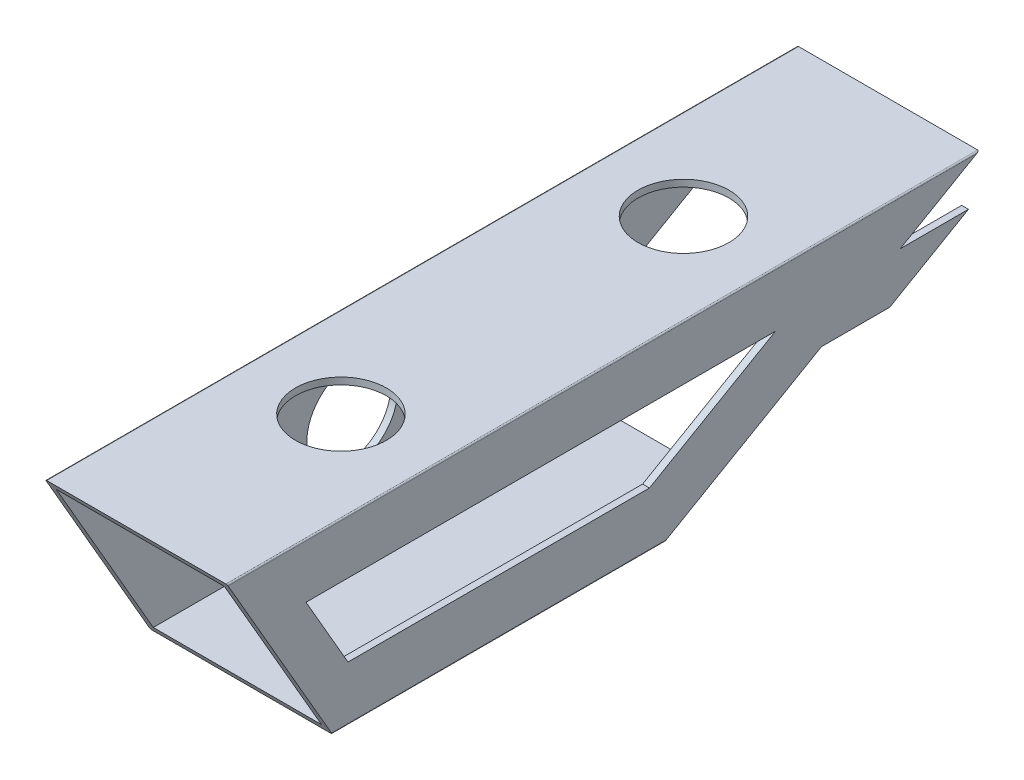
ISO-10303-21;
HEADER;
FILE_DESCRIPTION(('STEP AP214'),'2;1');
FILE_NAME('part.step','',(''),(''),'','','');
FILE_SCHEMA(('AUTOMOTIVE_DESIGN { 1 0 10303 214 1 1 1 1 }'));
ENDSEC;
DATA;
#1=APPLICATION_CONTEXT('core data for automotive mechanical design processes');
#2=APPLICATION_PROTOCOL_DEFINITION('international standard','automotive_design',2000,#1);
#3=PRODUCT_CONTEXT('',#1,'mechanical');
#4=PRODUCT('Part','Part','',(#3));
#5=PRODUCT_RELATED_PRODUCT_CATEGORY('part','',(#4));
#6=PRODUCT_DEFINITION_FORMATION('','',#4);
#7=PRODUCT_DEFINITION_CONTEXT('part definition',#1,'design');
#8=PRODUCT_DEFINITION('design','',#6,#7);
#9=PRODUCT_DEFINITION_SHAPE('','',#8);
#10=(LENGTH_UNIT() NAMED_UNIT(*) SI_UNIT(.MILLI.,.METRE.));
#11=(NAMED_UNIT(*) PLANE_ANGLE_UNIT() SI_UNIT($,.RADIAN.));
#12=(NAMED_UNIT(*) SI_UNIT($,.STERADIAN.) SOLID_ANGLE_UNIT());
#13=UNCERTAINTY_MEASURE_WITH_UNIT(LENGTH_MEASURE(1.E-05),#10,'distance_accuracy_value','');
#14=(GEOMETRIC_REPRESENTATION_CONTEXT(3) GLOBAL_UNCERTAINTY_ASSIGNED_CONTEXT((#13)) GLOBAL_UNIT_ASSIGNED_CONTEXT((#10,
#11,#12)) REPRESENTATION_CONTEXT('',''));
#15=CARTESIAN_POINT('',(0.,0.,0.));
#16=DIRECTION('',(0.,0.,1.));
#17=DIRECTION('',(1.,0.,0.));
#18=AXIS2_PLACEMENT_3D('',#15,#16,#17);
#19=CARTESIAN_POINT('',(-9.99999999999999,40.,0.));
#20=DIRECTION('',(0.,0.866025403784436,0.500000000000004));
#21=DIRECTION('',(0.,-0.500000000000004,0.866025403784436));
#22=AXIS2_PLACEMENT_3D('',#19,#20,#21);
#23=PLANE('',#22);
#24=DIRECTION('',(1.,0.,0.));
#25=VECTOR('',#24,1.);
#26=CARTESIAN_POINT('',(38.5,30.0000000000004,17.3205080756879));
#27=LINE('',#26,#25);
#28=CARTESIAN_POINT('',(38.5,30.0000000000004,17.3205080756879));
#29=VERTEX_POINT('',#28);
#30=CARTESIAN_POINT('',(40.,30.0000000000004,17.3205080756879));
#31=VERTEX_POINT('',#30);
#32=EDGE_CURVE('E259',#29,#31,#27,.T.);
#33=ORIENTED_EDGE('',*,*,#32,.F.);
#34=DIRECTION('',(0.,0.500000000000004,-0.866025403784436));
#35=VECTOR('',#34,1.);
#36=CARTESIAN_POINT('',(38.5,-41.223650257879,140.68348902285));
#37=LINE('',#36,#35);
#38=CARTESIAN_POINT('',(38.5,38.5,2.59807621135327));
#39=VERTEX_POINT('',#38);
#40=EDGE_CURVE('E365',#29,#39,#37,.T.);
#41=ORIENTED_EDGE('',*,*,#40,.T.);
#42=DIRECTION('',(-1.,0.,0.));
#43=VECTOR('',#42,1.);
#44=CARTESIAN_POINT('',(1.5,38.5,2.59807621135327));
#45=LINE('',#44,#43);
#46=CARTESIAN_POINT('',(1.5,38.5,2.59807621135327));
#47=VERTEX_POINT('',#46);
#48=EDGE_CURVE('E11',#39,#47,#45,.T.);
#49=ORIENTED_EDGE('',*,*,#48,.T.);
#50=DIRECTION('',(0.,-0.500000000000004,0.866025403784436));
#51=VECTOR('',#50,1.);
#52=CARTESIAN_POINT('',(1.5,-41.223650257879,140.68348902285));
#53=LINE('',#52,#51);
#54=CARTESIAN_POINT('',(1.5,1.5,66.683956091401));
#55=VERTEX_POINT('',#54);
#56=EDGE_CURVE('E374',#47,#55,#53,.T.);
#57=ORIENTED_EDGE('',*,*,#56,.T.);
#58=DIRECTION('',(1.,0.,0.));
#59=VECTOR('',#58,1.);
#60=CARTESIAN_POINT('',(1.5,1.5,66.683956091401));
#61=LINE('',#60,#59);
#62=CARTESIAN_POINT('',(10.,1.5,66.6839560914018));
#63=VERTEX_POINT('',#62);
#64=EDGE_CURVE('E370',#55,#63,#61,.T.);
#65=ORIENTED_EDGE('',*,*,#64,.T.);
#66=DIRECTION('',(0.,0.500000000000108,-0.866025403784376));
#67=VECTOR('',#66,1.);
#68=CARTESIAN_POINT('',(10.,1.5,66.6839560914018));
#69=LINE('',#68,#67);
#70=CARTESIAN_POINT('',(10.,0.,69.2820323027543));
#71=VERTEX_POINT('',#70);
#72=EDGE_CURVE('E284',#71,#63,#69,.T.);
#73=ORIENTED_EDGE('',*,*,#72,.F.);
#74=DIRECTION('',(1.,0.,0.));
#75=VECTOR('',#74,1.);
#76=CARTESIAN_POINT('',(-9.99999999999999,0.,69.2820323027543));
#77=LINE('',#76,#75);
#78=CARTESIAN_POINT('',(0.305025041444909,0.,69.2820323027543));
#79=VERTEX_POINT('',#78);
#80=EDGE_CURVE('E327',#79,#71,#77,.T.);
#81=ORIENTED_EDGE('',*,*,#80,.F.);
#82=CARTESIAN_POINT('',(0.305025041444907,0.305025041444907,68.753713433391));
#83=DIRECTION('',(0.,0.866025403784436,0.500000000000004));
#84=DIRECTION('',(0.,0.500000000000004,-0.866025403784436));
#85=AXIS2_PLACEMENT_3D('',#82,#83,#84);
#86=ELLIPSE('',#85,0.610050082889808,0.305025041444907);
#87=CARTESIAN_POINT('',(0.,0.305025041444909,68.753713433391));
#88=VERTEX_POINT('',#87);
#89=EDGE_CURVE('E385',#88,#79,#86,.T.);
#90=ORIENTED_EDGE('',*,*,#89,.F.);
#91=DIRECTION('',(0.,-0.500000000000004,0.866025403784436));
#92=VECTOR('',#91,1.);
#93=CARTESIAN_POINT('',(0.,-41.5223939975178,141.200928358347));
#94=LINE('',#93,#92);
#95=CARTESIAN_POINT('',(0.,39.6949749585551,0.528318869363359));
#96=VERTEX_POINT('',#95);
#97=EDGE_CURVE('E389',#96,#88,#94,.T.);
#98=ORIENTED_EDGE('',*,*,#97,.F.);
#99=CARTESIAN_POINT('',(0.305025041444907,39.6949749585551,0.528318869363359));
#100=DIRECTION('',(0.,0.866025403784436,0.500000000000004));
#101=DIRECTION('',(0.,0.500000000000004,-0.866025403784436));
#102=AXIS2_PLACEMENT_3D('',#99,#100,#101);
#103=ELLIPSE('',#102,0.610050082889805,0.305025041444905);
#104=CARTESIAN_POINT('',(0.305025041444909,40.,0.));
#105=VERTEX_POINT('',#104);
#106=EDGE_CURVE('E393',#105,#96,#103,.T.);
#107=ORIENTED_EDGE('',*,*,#106,.F.);
#108=DIRECTION('',(-1.,0.,0.));
#109=VECTOR('',#108,1.);
#110=CARTESIAN_POINT('',(0.305025041444909,40.,0.));
#111=LINE('',#110,#109);
#112=CARTESIAN_POINT('',(39.6949749585551,40.,0.));
#113=VERTEX_POINT('',#112);
#114=EDGE_CURVE('E413',#113,#105,#111,.T.);
#115=ORIENTED_EDGE('',*,*,#114,.F.);
#116=CARTESIAN_POINT('',(39.6949749585551,39.6949749585551,0.528318869363387));
#117=DIRECTION('',(0.,0.866025403784436,0.500000000000004));
#118=DIRECTION('',(0.,0.500000000000004,-0.866025403784436));
#119=AXIS2_PLACEMENT_3D('',#116,#117,#118);
#120=ELLIPSE('',#119,0.610050082889802,0.305025041444903);
#121=CARTESIAN_POINT('',(40.,39.6949749585551,0.528318869363388));
#122=VERTEX_POINT('',#121);
#123=EDGE_CURVE('E377',#122,#113,#120,.T.);
#124=ORIENTED_EDGE('',*,*,#123,.F.);
#125=DIRECTION('',(0.,-0.500000000000004,0.866025403784436));
#126=VECTOR('',#125,1.);
#127=CARTESIAN_POINT('',(40.,40.,0.));
#128=LINE('',#127,#126);
#129=EDGE_CURVE('E322',#122,#31,#128,.T.);
#130=ORIENTED_EDGE('',*,*,#129,.T.);
#131=EDGE_LOOP('',(#33,#41,#49,#57,#65,#73,#81,#90,#98,#107,#115,#124,#130));
#132=FACE_BOUND('',#131,.T.);
#133=ADVANCED_FACE('F38',(#132),#23,.F.);
#134=DIRECTION('',(1.,0.,0.));
#135=VECTOR('',#134,1.);
#136=CARTESIAN_POINT('',(38.5,20.,34.6410161513772));
#137=LINE('',#136,#135);
#138=CARTESIAN_POINT('',(38.5,20.,34.6410161513771));
#139=VERTEX_POINT('',#138);
#140=CARTESIAN_POINT('',(40.,20.,34.6410161513772));
#141=VERTEX_POINT('',#140);
#142=EDGE_CURVE('E272',#139,#141,#137,.T.);
#143=ORIENTED_EDGE('',*,*,#142,.T.);
#144=CARTESIAN_POINT('',(40.,0.30502504144491,68.7537134333909));
#145=VERTEX_POINT('',#144);
#146=EDGE_CURVE('E326',#141,#145,#128,.T.);
#147=ORIENTED_EDGE('',*,*,#146,.T.);
#148=CARTESIAN_POINT('',(39.6949749585551,0.305025041444907,68.753713433391));
#149=DIRECTION('',(0.,0.866025403784436,0.500000000000004));
#150=DIRECTION('',(0.,0.500000000000004,-0.866025403784436));
#151=AXIS2_PLACEMENT_3D('',#148,#149,#150);
#152=ELLIPSE('',#151,0.610050082889805,0.305025041444905);
#153=CARTESIAN_POINT('',(39.6949749585551,0.,69.2820323027543));
#154=VERTEX_POINT('',#153);
#155=EDGE_CURVE('E381',#154,#145,#152,.T.);
#156=ORIENTED_EDGE('',*,*,#155,.F.);
#157=CARTESIAN_POINT('',(30.,0.,69.2820323027543));
#158=VERTEX_POINT('',#157);
#159=EDGE_CURVE('E325',#158,#154,#77,.T.);
#160=ORIENTED_EDGE('',*,*,#159,.F.);
#161=DIRECTION('',(0.,0.500000000000108,-0.866025403784376));
#162=VECTOR('',#161,1.);
#163=CARTESIAN_POINT('',(30.,1.5,66.6839560914018));
#164=LINE('',#163,#162);
#165=CARTESIAN_POINT('',(30.,1.5,66.683956091401));
#166=VERTEX_POINT('',#165);
#167=EDGE_CURVE('E285',#158,#166,#164,.T.);
#168=ORIENTED_EDGE('',*,*,#167,.T.);
#169=CARTESIAN_POINT('',(38.5,1.5,66.683956091401));
#170=VERTEX_POINT('',#169);
#171=EDGE_CURVE('E369',#166,#170,#61,.T.);
#172=ORIENTED_EDGE('',*,*,#171,.T.);
#173=EDGE_CURVE('E366',#170,#139,#37,.T.);
#174=ORIENTED_EDGE('',*,*,#173,.T.);
#175=EDGE_LOOP('',(#143,#147,#156,#160,#168,#172,#174));
#176=FACE_BOUND('',#175,.T.);
#177=ADVANCED_FACE('F515',(#176),#23,.F.);
#178=CARTESIAN_POINT('',(1.5,38.5,165.35));
#179=DIRECTION('',(0.,-1.,0.));
#180=DIRECTION('',(0.,0.,-1.));
#181=AXIS2_PLACEMENT_3D('',#178,#179,#180);
#182=PLANE('',#181);
#183=CARTESIAN_POINT('',(20.,38.5,120.35));
#184=DIRECTION('',(0.,-1.,0.));
#185=DIRECTION('',(0.,0.,-1.));
#186=AXIS2_PLACEMENT_3D('',#183,#184,#185);
#187=CIRCLE('',#186,10.);
#188=CARTESIAN_POINT('',(20.,38.5,110.35));
#189=VERTEX_POINT('',#188);
#190=EDGE_CURVE('E601',#189,#189,#187,.T.);
#191=ORIENTED_EDGE('',*,*,#190,.F.);
#192=EDGE_LOOP('',(#191));
#193=FACE_BOUND('',#192,.T.);
#194=CARTESIAN_POINT('',(20.,38.5,45.));
#195=DIRECTION('',(0.,-1.,0.));
#196=DIRECTION('',(0.,0.,-1.));
#197=AXIS2_PLACEMENT_3D('',#194,#195,#196);
#198=CIRCLE('',#197,10.);
#199=CARTESIAN_POINT('',(20.,38.5,35.));
#200=VERTEX_POINT('',#199);
#201=EDGE_CURVE('E596',#200,#200,#198,.T.);
#202=ORIENTED_EDGE('',*,*,#201,.F.);
#203=EDGE_LOOP('',(#202));
#204=FACE_BOUND('',#203,.T.);
#205=ORIENTED_EDGE('',*,*,#48,.F.);
#206=DIRECTION('',(0.,0.,-1.));
#207=VECTOR('',#206,1.);
#208=CARTESIAN_POINT('',(38.5,38.5,165.35));
#209=LINE('',#208,#207);
#210=CARTESIAN_POINT('',(38.5,38.5,164.483974596216));
#211=VERTEX_POINT('',#210);
#212=EDGE_CURVE('E401',#211,#39,#209,.T.);
#213=ORIENTED_EDGE('',*,*,#212,.F.);
#214=DIRECTION('',(1.,0.,0.));
#215=VECTOR('',#214,1.);
#216=CARTESIAN_POINT('',(1.5,38.5,164.483974596216));
#217=LINE('',#216,#215);
#218=CARTESIAN_POINT('',(1.5,38.5,164.483974596216));
#219=VERTEX_POINT('',#218);
#220=EDGE_CURVE('E48',#219,#211,#217,.T.);
#221=ORIENTED_EDGE('',*,*,#220,.F.);
#222=DIRECTION('',(0.,0.,-1.));
#223=VECTOR('',#222,1.);
#224=CARTESIAN_POINT('',(1.5,38.5,165.35));
#225=LINE('',#224,#223);
#226=EDGE_CURVE('E397',#219,#47,#225,.T.);
#227=ORIENTED_EDGE('',*,*,#226,.T.);
#228=EDGE_LOOP('',(#205,#213,#221,#227));
#229=FACE_BOUND('',#228,.T.);
#230=ADVANCED_FACE('F469',(#193,#204,#229),#182,.T.);
#231=CARTESIAN_POINT('',(38.5,1.5,165.35));
#232=DIRECTION('',(-1.,0.,0.));
#233=DIRECTION('',(0.,0.,1.));
#234=AXIS2_PLACEMENT_3D('',#231,#232,#233);
#235=PLANE('',#234);
#236=DIRECTION('',(0.,0.,-1.));
#237=VECTOR('',#236,1.);
#238=CARTESIAN_POINT('',(38.5,28.,165.35));
#239=LINE('',#238,#237);
#240=CARTESIAN_POINT('',(38.5,28.,148.029491924312));
#241=VERTEX_POINT('',#240);
#242=CARTESIAN_POINT('',(38.5,28.,44.7846096908261));
#243=VERTEX_POINT('',#242);
#244=EDGE_CURVE('E243',#241,#243,#239,.T.);
#245=ORIENTED_EDGE('',*,*,#244,.F.);
#246=DIRECTION('',(0.,0.866025403784438,0.500000000000001));
#247=VECTOR('',#246,1.);
#248=CARTESIAN_POINT('',(38.5,15.6249999999999,140.88478234309));
#249=LINE('',#248,#247);
#250=CARTESIAN_POINT('',(38.5,12.,138.791887617277));
#251=VERTEX_POINT('',#250);
#252=EDGE_CURVE('E231',#251,#241,#249,.T.);
#253=ORIENTED_EDGE('',*,*,#252,.F.);
#254=DIRECTION('',(0.,0.,1.));
#255=VECTOR('',#254,1.);
#256=CARTESIAN_POINT('',(38.5,12.,165.35));
#257=LINE('',#256,#255);
#258=CARTESIAN_POINT('',(38.5,12.,72.4974226119282));
#259=VERTEX_POINT('',#258);
#260=EDGE_CURVE('E206',#259,#251,#257,.T.);
#261=ORIENTED_EDGE('',*,*,#260,.F.);
#262=DIRECTION('',(0.,-0.5,0.866025403784439));
#263=VECTOR('',#262,1.);
#264=CARTESIAN_POINT('',(38.5,-30.8313454124654,146.68348902285));
#265=LINE('',#264,#263);
#266=EDGE_CURVE('E240',#243,#259,#265,.T.);
#267=ORIENTED_EDGE('',*,*,#266,.F.);
#268=EDGE_LOOP('',(#245,#253,#261,#267));
#269=FACE_BOUND('',#268,.T.);
#270=ORIENTED_EDGE('',*,*,#173,.F.);
#271=DIRECTION('',(0.,0.,-1.));
#272=VECTOR('',#271,1.);
#273=CARTESIAN_POINT('',(38.5,1.5,165.35));
#274=LINE('',#273,#272);
#275=CARTESIAN_POINT('',(38.5,1.5,143.1220146362));
#276=VERTEX_POINT('',#275);
#277=EDGE_CURVE('E405',#276,#170,#274,.T.);
#278=ORIENTED_EDGE('',*,*,#277,.F.);
#279=DIRECTION('',(0.,-0.866025403784442,-0.499999999999995));
#280=VECTOR('',#279,1.);
#281=CARTESIAN_POINT('',(38.5,11.1249999999998,148.67901097715));
#282=LINE('',#281,#280);
#283=EDGE_CURVE('E331',#211,#276,#282,.T.);
#284=ORIENTED_EDGE('',*,*,#283,.F.);
#285=ORIENTED_EDGE('',*,*,#212,.T.);
#286=ORIENTED_EDGE('',*,*,#40,.F.);
#287=DIRECTION('',(0.,0.,-1.));
#288=VECTOR('',#287,1.);
#289=CARTESIAN_POINT('',(38.5,30.0000000000004,17.3205080756879));
#290=LINE('',#289,#288);
#291=CARTESIAN_POINT('',(38.5,30.0000000000004,2.32050807568812));
#292=VERTEX_POINT('',#291);
#293=EDGE_CURVE('E247',#29,#292,#290,.T.);
#294=ORIENTED_EDGE('',*,*,#293,.T.);
#295=DIRECTION('',(0.,-0.5,0.866025403784439));
#296=VECTOR('',#295,1.);
#297=CARTESIAN_POINT('',(38.5,30.0000000000004,2.32050807568812));
#298=LINE('',#297,#296);
#299=CARTESIAN_POINT('',(38.5,20.0000000000003,19.641016151377));
#300=VERTEX_POINT('',#299);
#301=EDGE_CURVE('E251',#292,#300,#298,.T.);
#302=ORIENTED_EDGE('',*,*,#301,.T.);
#303=DIRECTION('',(0.,0.,1.));
#304=VECTOR('',#303,1.);
#305=CARTESIAN_POINT('',(38.5,20.0000000000003,19.641016151377));
#306=LINE('',#305,#304);
#307=EDGE_CURVE('E255',#300,#139,#306,.T.);
#308=ORIENTED_EDGE('',*,*,#307,.T.);
#309=EDGE_LOOP('',(#270,#278,#284,#285,#286,#294,#302,#308));
#310=FACE_BOUND('',#309,.T.);
#311=ADVANCED_FACE('F466',(#269,#310),#235,.T.);
#312=CARTESIAN_POINT('',(1.5,1.5,165.35));
#313=DIRECTION('',(0.,1.,0.));
#314=DIRECTION('',(0.,0.,1.));
#315=AXIS2_PLACEMENT_3D('',#312,#313,#314);
#316=PLANE('',#315);
#317=ORIENTED_EDGE('',*,*,#64,.F.);
#318=DIRECTION('',(0.,0.,-1.));
#319=VECTOR('',#318,1.);
#320=CARTESIAN_POINT('',(1.5,1.5,165.35));
#321=LINE('',#320,#319);
#322=CARTESIAN_POINT('',(1.5,1.5,143.1220146362));
#323=VERTEX_POINT('',#322);
#324=EDGE_CURVE('E409',#323,#55,#321,.T.);
#325=ORIENTED_EDGE('',*,*,#324,.F.);
#326=DIRECTION('',(-1.,0.,0.));
#327=VECTOR('',#326,1.);
#328=CARTESIAN_POINT('',(1.5,1.5,143.1220146362));
#329=LINE('',#328,#327);
#330=EDGE_CURVE('E339',#276,#323,#329,.T.);
#331=ORIENTED_EDGE('',*,*,#330,.F.);
#332=ORIENTED_EDGE('',*,*,#277,.T.);
#333=ORIENTED_EDGE('',*,*,#171,.F.);
#334=DIRECTION('',(0.,0.,-1.));
#335=VECTOR('',#334,1.);
#336=CARTESIAN_POINT('',(30.,1.5,52.2820323027543));
#337=LINE('',#336,#335);
#338=CARTESIAN_POINT('',(30.,1.5,52.2820323027543));
#339=VERTEX_POINT('',#338);
#340=EDGE_CURVE('E289',#166,#339,#337,.T.);
#341=ORIENTED_EDGE('',*,*,#340,.T.);
#342=DIRECTION('',(-1.,0.,0.));
#343=VECTOR('',#342,1.);
#344=CARTESIAN_POINT('',(30.,1.5,52.2820323027543));
#345=LINE('',#344,#343);
#346=CARTESIAN_POINT('',(10.,1.5,52.2820323027543));
#347=VERTEX_POINT('',#346);
#348=EDGE_CURVE('E302',#339,#347,#345,.T.);
#349=ORIENTED_EDGE('',*,*,#348,.T.);
#350=DIRECTION('',(0.,0.,-1.));
#351=VECTOR('',#350,1.);
#352=CARTESIAN_POINT('',(10.,1.5,52.2820323027543));
#353=LINE('',#352,#351);
#354=EDGE_CURVE('E306',#63,#347,#353,.T.);
#355=ORIENTED_EDGE('',*,*,#354,.F.);
#356=EDGE_LOOP('',(#317,#325,#331,#332,#333,#341,#349,#355));
#357=FACE_BOUND('',#356,.T.);
#358=ADVANCED_FACE('F477',(#357),#316,.T.);
#359=CARTESIAN_POINT('',(1.5,1.5,165.35));
#360=DIRECTION('',(1.,0.,0.));
#361=DIRECTION('',(0.,0.,-1.));
#362=AXIS2_PLACEMENT_3D('',#359,#360,#361);
#363=PLANE('',#362);
#364=CARTESIAN_POINT('',(1.5,20.,99.35));
#365=DIRECTION('',(1.,0.,0.));
#366=DIRECTION('',(0.,0.,-1.));
#367=AXIS2_PLACEMENT_3D('',#364,#365,#366);
#368=CIRCLE('',#367,9.99999999999999);
#369=CARTESIAN_POINT('',(1.5,20.,89.35));
#370=VERTEX_POINT('',#369);
#371=EDGE_CURVE('E583',#370,#370,#368,.T.);
#372=ORIENTED_EDGE('',*,*,#371,.F.);
#373=EDGE_LOOP('',(#372));
#374=FACE_BOUND('',#373,.T.);
#375=ORIENTED_EDGE('',*,*,#56,.F.);
#376=ORIENTED_EDGE('',*,*,#226,.F.);
#377=DIRECTION('',(0.,0.866025403784442,0.499999999999995));
#378=VECTOR('',#377,1.);
#379=CARTESIAN_POINT('',(1.5,11.1249999999998,148.67901097715));
#380=LINE('',#379,#378);
#381=EDGE_CURVE('E342',#323,#219,#380,.T.);
#382=ORIENTED_EDGE('',*,*,#381,.F.);
#383=ORIENTED_EDGE('',*,*,#324,.T.);
#384=EDGE_LOOP('',(#375,#376,#382,#383));
#385=FACE_BOUND('',#384,.T.);
#386=ADVANCED_FACE('F474',(#374,#385),#363,.T.);
#387=CARTESIAN_POINT('',(-9.99999999999999,40.,165.35));
#388=DIRECTION('',(0.,0.499999999999995,-0.866025403784442));
#389=DIRECTION('',(0.,0.866025403784442,0.499999999999995));
#390=AXIS2_PLACEMENT_3D('',#387,#388,#389);
#391=PLANE('',#390);
#392=ORIENTED_EDGE('',*,*,#381,.T.);
#393=ORIENTED_EDGE('',*,*,#220,.T.);
#394=ORIENTED_EDGE('',*,*,#283,.T.);
#395=ORIENTED_EDGE('',*,*,#330,.T.);
#396=EDGE_LOOP('',(#392,#393,#394,#395));
#397=FACE_BOUND('',#396,.T.);
#398=DIRECTION('',(0.,0.866025403784442,0.499999999999995));
#399=VECTOR('',#398,1.);
#400=CARTESIAN_POINT('',(0.,10.2287687810835,148.161571641652));
#401=LINE('',#400,#399);
#402=CARTESIAN_POINT('',(0.,0.305025041444909,142.432095522203));
#403=VERTEX_POINT('',#402);
#404=CARTESIAN_POINT('',(0.,39.6949749585551,165.173893710212));
#405=VERTEX_POINT('',#404);
#406=EDGE_CURVE('E357',#403,#405,#401,.T.);
#407=ORIENTED_EDGE('',*,*,#406,.F.);
#408=CARTESIAN_POINT('',(0.305025041444907,0.305025041444907,142.432095522203));
#409=DIRECTION('',(0.,0.499999999999995,-0.866025403784442));
#410=DIRECTION('',(0.,-0.866025403784442,-0.499999999999995));
#411=AXIS2_PLACEMENT_3D('',#408,#409,#410);
#412=ELLIPSE('',#411,0.352212579575586,0.305025041444907);
#413=CARTESIAN_POINT('',(0.305025041444909,0.,142.255989232415));
#414=VERTEX_POINT('',#413);
#415=EDGE_CURVE('E353',#414,#403,#412,.T.);
#416=ORIENTED_EDGE('',*,*,#415,.F.);
#417=DIRECTION('',(1.,0.,0.));
#418=VECTOR('',#417,1.);
#419=CARTESIAN_POINT('',(-9.99999999999999,0.,142.255989232415));
#420=LINE('',#419,#418);
#421=CARTESIAN_POINT('',(39.6949749585551,0.,142.255989232415));
#422=VERTEX_POINT('',#421);
#423=EDGE_CURVE('E334',#414,#422,#420,.T.);
#424=ORIENTED_EDGE('',*,*,#423,.T.);
#425=CARTESIAN_POINT('',(39.6949749585551,0.305025041444907,142.432095522203));
#426=DIRECTION('',(0.,0.499999999999995,-0.866025403784442));
#427=DIRECTION('',(0.,-0.866025403784442,-0.499999999999995));
#428=AXIS2_PLACEMENT_3D('',#425,#426,#427);
#429=ELLIPSE('',#428,0.352212579575584,0.305025041444905);
#430=CARTESIAN_POINT('',(40.,0.305025041444917,142.432095522203));
#431=VERTEX_POINT('',#430);
#432=EDGE_CURVE('E349',#431,#422,#429,.T.);
#433=ORIENTED_EDGE('',*,*,#432,.F.);
#434=DIRECTION('',(0.,0.866025403784442,0.499999999999995));
#435=VECTOR('',#434,1.);
#436=CARTESIAN_POINT('',(40.,40.,165.35));
#437=LINE('',#436,#435);
#438=CARTESIAN_POINT('',(40.,39.6949749585551,165.173893710212));
#439=VERTEX_POINT('',#438);
#440=EDGE_CURVE('E319',#431,#439,#437,.T.);
#441=ORIENTED_EDGE('',*,*,#440,.T.);
#442=CARTESIAN_POINT('',(39.6949749585551,39.6949749585551,165.173893710212));
#443=DIRECTION('',(0.,0.499999999999995,-0.866025403784442));
#444=DIRECTION('',(0.,-0.866025403784442,-0.499999999999995));
#445=AXIS2_PLACEMENT_3D('',#442,#443,#444);
#446=ELLIPSE('',#445,0.352212579575582,0.305025041444903);
#447=CARTESIAN_POINT('',(39.6949749585551,40.,165.35));
#448=VERTEX_POINT('',#447);
#449=EDGE_CURVE('E345',#448,#439,#446,.T.);
#450=ORIENTED_EDGE('',*,*,#449,.F.);
#451=DIRECTION('',(-1.,0.,0.));
#452=VECTOR('',#451,1.);
#453=CARTESIAN_POINT('',(0.305025041444909,40.,165.35));
#454=LINE('',#453,#452);
#455=CARTESIAN_POINT('',(0.305025041444909,40.,165.35));
#456=VERTEX_POINT('',#455);
#457=EDGE_CURVE('E414',#448,#456,#454,.T.);
#458=ORIENTED_EDGE('',*,*,#457,.T.);
#459=CARTESIAN_POINT('',(0.305025041444907,39.6949749585551,165.173893710212));
#460=DIRECTION('',(0.,0.499999999999995,-0.866025403784442));
#461=DIRECTION('',(0.,-0.866025403784442,-0.499999999999995));
#462=AXIS2_PLACEMENT_3D('',#459,#460,#461);
#463=ELLIPSE('',#462,0.352212579575584,0.305025041444905);
#464=EDGE_CURVE('E361',#405,#456,#463,.T.);
#465=ORIENTED_EDGE('',*,*,#464,.F.);
#466=EDGE_LOOP('',(#407,#416,#424,#433,#441,#450,#458,#465));
#467=FACE_BOUND('',#466,.T.);
#468=ADVANCED_FACE('F456',(#397,#467),#391,.F.);
#469=CARTESIAN_POINT('',(0.305025041444907,39.6949749585551,165.35));
#470=DIRECTION('',(0.,0.,-1.));
#471=DIRECTION('',(-1.,0.,0.));
#472=AXIS2_PLACEMENT_3D('',#469,#470,#471);
#473=CYLINDRICAL_SURFACE('',#472,0.305025041444905);
#474=DIRECTION('',(0.,0.,-1.));
#475=VECTOR('',#474,1.);
#476=CARTESIAN_POINT('',(0.305025041444909,40.,165.35));
#477=LINE('',#476,#475);
#478=EDGE_CURVE('E417',#456,#105,#477,.T.);
#479=ORIENTED_EDGE('',*,*,#478,.T.);
#480=ORIENTED_EDGE('',*,*,#106,.T.);
#481=DIRECTION('',(0.,0.,-1.));
#482=VECTOR('',#481,1.);
#483=CARTESIAN_POINT('',(0.,39.6949749585551,165.35));
#484=LINE('',#483,#482);
#485=EDGE_CURVE('E448',#405,#96,#484,.T.);
#486=ORIENTED_EDGE('',*,*,#485,.F.);
#487=ORIENTED_EDGE('',*,*,#464,.T.);
#488=EDGE_LOOP('',(#479,#480,#486,#487));
#489=FACE_BOUND('',#488,.T.);
#490=ADVANCED_FACE('F40',(#489),#473,.T.);
#491=CARTESIAN_POINT('',(0.,0.305025041444909,165.35));
#492=DIRECTION('',(1.,0.,0.));
#493=DIRECTION('',(0.,0.,-1.));
#494=AXIS2_PLACEMENT_3D('',#491,#492,#493);
#495=PLANE('',#494);
#496=CARTESIAN_POINT('',(0.,20.,99.35));
#497=DIRECTION('',(1.,0.,0.));
#498=DIRECTION('',(0.,0.,-1.));
#499=AXIS2_PLACEMENT_3D('',#496,#497,#498);
#500=CIRCLE('',#499,9.99999999999999);
#501=CARTESIAN_POINT('',(0.,20.,89.35));
#502=VERTEX_POINT('',#501);
#503=EDGE_CURVE('E42',#502,#502,#500,.T.);
#504=ORIENTED_EDGE('',*,*,#503,.T.);
#505=EDGE_LOOP('',(#504));
#506=FACE_BOUND('',#505,.T.);
#507=ORIENTED_EDGE('',*,*,#485,.T.);
#508=ORIENTED_EDGE('',*,*,#97,.T.);
#509=DIRECTION('',(0.,0.,-1.));
#510=VECTOR('',#509,1.);
#511=CARTESIAN_POINT('',(0.,0.305025041444909,165.35));
#512=LINE('',#511,#510);
#513=EDGE_CURVE('E444',#403,#88,#512,.T.);
#514=ORIENTED_EDGE('',*,*,#513,.F.);
#515=ORIENTED_EDGE('',*,*,#406,.T.);
#516=EDGE_LOOP('',(#507,#508,#514,#515));
#517=FACE_BOUND('',#516,.T.);
#518=ADVANCED_FACE('F490',(#506,#517),#495,.F.);
#519=CARTESIAN_POINT('',(0.305025041444907,0.305025041444907,165.35));
#520=DIRECTION('',(0.,0.,-1.));
#521=DIRECTION('',(-1.,0.,0.));
#522=AXIS2_PLACEMENT_3D('',#519,#520,#521);
#523=CYLINDRICAL_SURFACE('',#522,0.305025041444907);
#524=ORIENTED_EDGE('',*,*,#513,.T.);
#525=ORIENTED_EDGE('',*,*,#89,.T.);
#526=DIRECTION('',(0.,0.,-1.));
#527=VECTOR('',#526,1.);
#528=CARTESIAN_POINT('',(0.305025041444909,0.,165.35));
#529=LINE('',#528,#527);
#530=EDGE_CURVE('E440',#414,#79,#529,.T.);
#531=ORIENTED_EDGE('',*,*,#530,.F.);
#532=ORIENTED_EDGE('',*,*,#415,.T.);
#533=EDGE_LOOP('',(#524,#525,#531,#532));
#534=FACE_BOUND('',#533,.T.);
#535=ADVANCED_FACE('F487',(#534),#523,.T.);
#536=CARTESIAN_POINT('',(0.305025041444909,0.,165.35));
#537=DIRECTION('',(0.,1.,0.));
#538=DIRECTION('',(0.,0.,1.));
#539=AXIS2_PLACEMENT_3D('',#536,#537,#538);
#540=PLANE('',#539);
#541=ORIENTED_EDGE('',*,*,#530,.T.);
#542=ORIENTED_EDGE('',*,*,#80,.T.);
#543=DIRECTION('',(0.,0.,1.));
#544=VECTOR('',#543,1.);
#545=CARTESIAN_POINT('',(10.,0.,69.2820323027543));
#546=LINE('',#545,#544);
#547=CARTESIAN_POINT('',(10.,0.,52.2820323027543));
#548=VERTEX_POINT('',#547);
#549=EDGE_CURVE('E290',#548,#71,#546,.T.);
#550=ORIENTED_EDGE('',*,*,#549,.F.);
#551=DIRECTION('',(-1.,0.,0.));
#552=VECTOR('',#551,1.);
#553=CARTESIAN_POINT('',(30.,0.,52.2820323027543));
#554=LINE('',#553,#552);
#555=CARTESIAN_POINT('',(30.,0.,52.2820323027543));
#556=VERTEX_POINT('',#555);
#557=EDGE_CURVE('E316',#556,#548,#554,.T.);
#558=ORIENTED_EDGE('',*,*,#557,.F.);
#559=DIRECTION('',(0.,0.,1.));
#560=VECTOR('',#559,1.);
#561=CARTESIAN_POINT('',(30.,0.,69.2820323027543));
#562=LINE('',#561,#560);
#563=EDGE_CURVE('E298',#556,#158,#562,.T.);
#564=ORIENTED_EDGE('',*,*,#563,.T.);
#565=ORIENTED_EDGE('',*,*,#159,.T.);
#566=DIRECTION('',(0.,0.,-1.));
#567=VECTOR('',#566,1.);
#568=CARTESIAN_POINT('',(39.6949749585551,0.,165.35));
#569=LINE('',#568,#567);
#570=EDGE_CURVE('E436',#422,#154,#569,.T.);
#571=ORIENTED_EDGE('',*,*,#570,.F.);
#572=ORIENTED_EDGE('',*,*,#423,.F.);
#573=EDGE_LOOP('',(#541,#542,#550,#558,#564,#565,#571,#572));
#574=FACE_BOUND('',#573,.T.);
#575=ADVANCED_FACE('F482',(#574),#540,.F.);
#576=CARTESIAN_POINT('',(39.6949749585551,0.305025041444907,165.35));
#577=DIRECTION('',(0.,0.,-1.));
#578=DIRECTION('',(-1.,0.,0.));
#579=AXIS2_PLACEMENT_3D('',#576,#577,#578);
#580=CYLINDRICAL_SURFACE('',#579,0.305025041444905);
#581=ORIENTED_EDGE('',*,*,#570,.T.);
#582=ORIENTED_EDGE('',*,*,#155,.T.);
#583=DIRECTION('',(0.,0.,-1.));
#584=VECTOR('',#583,1.);
#585=CARTESIAN_POINT('',(40.,0.305025041444907,165.35));
#586=LINE('',#585,#584);
#587=EDGE_CURVE('E432',#431,#145,#586,.T.);
#588=ORIENTED_EDGE('',*,*,#587,.F.);
#589=ORIENTED_EDGE('',*,*,#432,.T.);
#590=EDGE_LOOP('',(#581,#582,#588,#589));
#591=FACE_BOUND('',#590,.T.);
#592=ADVANCED_FACE('F520',(#591),#580,.T.);
#593=CARTESIAN_POINT('',(40.,0.305025041444909,165.35));
#594=DIRECTION('',(-1.,0.,0.));
#595=DIRECTION('',(0.,0.,1.));
#596=AXIS2_PLACEMENT_3D('',#593,#594,#595);
#597=PLANE('',#596);
#598=DIRECTION('',(0.,-0.866025403784438,-0.500000000000001));
#599=VECTOR('',#598,1.);
#600=CARTESIAN_POINT('',(40.,12.,138.791887617277));
#601=LINE('',#600,#599);
#602=CARTESIAN_POINT('',(40.,28.,148.029491924312));
#603=VERTEX_POINT('',#602);
#604=CARTESIAN_POINT('',(40.,12.,138.791887617277));
#605=VERTEX_POINT('',#604);
#606=EDGE_CURVE('E213',#603,#605,#601,.T.);
#607=ORIENTED_EDGE('',*,*,#606,.F.);
#608=DIRECTION('',(0.,0.,1.));
#609=VECTOR('',#608,1.);
#610=CARTESIAN_POINT('',(40.,28.,148.029491924312));
#611=LINE('',#610,#609);
#612=CARTESIAN_POINT('',(40.,28.,44.7846096908261));
#613=VERTEX_POINT('',#612);
#614=EDGE_CURVE('E63',#613,#603,#611,.T.);
#615=ORIENTED_EDGE('',*,*,#614,.F.);
#616=DIRECTION('',(0.,0.5,-0.866025403784439));
#617=VECTOR('',#616,1.);
#618=CARTESIAN_POINT('',(40.,28.,44.7846096908261));
#619=LINE('',#618,#617);
#620=CARTESIAN_POINT('',(40.,12.,72.4974226119282));
#621=VERTEX_POINT('',#620);
#622=EDGE_CURVE('E221',#621,#613,#619,.T.);
#623=ORIENTED_EDGE('',*,*,#622,.F.);
#624=DIRECTION('',(0.,0.,-1.));
#625=VECTOR('',#624,1.);
#626=CARTESIAN_POINT('',(40.,12.,72.4974226119282));
#627=LINE('',#626,#625);
#628=EDGE_CURVE('E203',#605,#621,#627,.T.);
#629=ORIENTED_EDGE('',*,*,#628,.F.);
#630=EDGE_LOOP('',(#607,#615,#623,#629));
#631=FACE_BOUND('',#630,.T.);
#632=ORIENTED_EDGE('',*,*,#587,.T.);
#633=ORIENTED_EDGE('',*,*,#146,.F.);
#634=DIRECTION('',(0.,0.,1.));
#635=VECTOR('',#634,1.);
#636=CARTESIAN_POINT('',(40.,20.0000000000003,19.641016151377));
#637=LINE('',#636,#635);
#638=CARTESIAN_POINT('',(40.,20.0000000000003,19.641016151377));
#639=VERTEX_POINT('',#638);
#640=EDGE_CURVE('E252',#639,#141,#637,.T.);
#641=ORIENTED_EDGE('',*,*,#640,.F.);
#642=DIRECTION('',(0.,-0.5,0.866025403784439));
#643=VECTOR('',#642,1.);
#644=CARTESIAN_POINT('',(40.,30.0000000000004,2.32050807568812));
#645=LINE('',#644,#643);
#646=CARTESIAN_POINT('',(40.,30.0000000000004,2.32050807568812));
#647=VERTEX_POINT('',#646);
#648=EDGE_CURVE('E263',#647,#639,#645,.T.);
#649=ORIENTED_EDGE('',*,*,#648,.F.);
#650=DIRECTION('',(0.,0.,-1.));
#651=VECTOR('',#650,1.);
#652=CARTESIAN_POINT('',(40.,30.0000000000004,17.3205080756879));
#653=LINE('',#652,#651);
#654=EDGE_CURVE('E246',#31,#647,#653,.T.);
#655=ORIENTED_EDGE('',*,*,#654,.F.);
#656=ORIENTED_EDGE('',*,*,#129,.F.);
#657=DIRECTION('',(0.,0.,-1.));
#658=VECTOR('',#657,1.);
#659=CARTESIAN_POINT('',(40.,39.6949749585551,165.35));
#660=LINE('',#659,#658);
#661=EDGE_CURVE('E428',#439,#122,#660,.T.);
#662=ORIENTED_EDGE('',*,*,#661,.F.);
#663=ORIENTED_EDGE('',*,*,#440,.F.);
#664=EDGE_LOOP('',(#632,#633,#641,#649,#655,#656,#662,#663));
#665=FACE_BOUND('',#664,.T.);
#666=ADVANCED_FACE('F218',(#631,#665),#597,.F.);
#667=CARTESIAN_POINT('',(39.6949749585551,39.6949749585551,165.35));
#668=DIRECTION('',(0.,0.,-1.));
#669=DIRECTION('',(-1.,0.,0.));
#670=AXIS2_PLACEMENT_3D('',#667,#668,#669);
#671=CYLINDRICAL_SURFACE('',#670,0.305025041444903);
#672=ORIENTED_EDGE('',*,*,#661,.T.);
#673=ORIENTED_EDGE('',*,*,#123,.T.);
#674=DIRECTION('',(0.,0.,-1.));
#675=VECTOR('',#674,1.);
#676=CARTESIAN_POINT('',(39.6949749585551,40.,165.35));
#677=LINE('',#676,#675);
#678=EDGE_CURVE('E424',#448,#113,#677,.T.);
#679=ORIENTED_EDGE('',*,*,#678,.F.);
#680=ORIENTED_EDGE('',*,*,#449,.T.);
#681=EDGE_LOOP('',(#672,#673,#679,#680));
#682=FACE_BOUND('',#681,.T.);
#683=ADVANCED_FACE('F499',(#682),#671,.T.);
#684=CARTESIAN_POINT('',(0.305025041444909,40.,165.35));
#685=DIRECTION('',(0.,-1.,0.));
#686=DIRECTION('',(1.,0.,0.));
#687=AXIS2_PLACEMENT_3D('',#684,#685,#686);
#688=PLANE('',#687);
#689=CARTESIAN_POINT('',(20.,40.,120.35));
#690=DIRECTION('',(0.,1.,0.));
#691=DIRECTION('',(-1.,0.,0.));
#692=AXIS2_PLACEMENT_3D('',#689,#690,#691);
#693=CIRCLE('',#692,10.);
#694=CARTESIAN_POINT('',(10.,40.,120.35));
#695=VERTEX_POINT('',#694);
#696=EDGE_CURVE('E587',#695,#695,#693,.T.);
#697=ORIENTED_EDGE('',*,*,#696,.F.);
#698=EDGE_LOOP('',(#697));
#699=FACE_BOUND('',#698,.T.);
#700=CARTESIAN_POINT('',(20.,40.,45.));
#701=DIRECTION('',(0.,1.,0.));
#702=DIRECTION('',(1.,0.,0.));
#703=AXIS2_PLACEMENT_3D('',#700,#701,#702);
#704=CIRCLE('',#703,10.);
#705=CARTESIAN_POINT('',(30.,40.,45.));
#706=VERTEX_POINT('',#705);
#707=EDGE_CURVE('E582',#706,#706,#704,.T.);
#708=ORIENTED_EDGE('',*,*,#707,.F.);
#709=EDGE_LOOP('',(#708));
#710=FACE_BOUND('',#709,.T.);
#711=ORIENTED_EDGE('',*,*,#114,.T.);
#712=ORIENTED_EDGE('',*,*,#478,.F.);
#713=ORIENTED_EDGE('',*,*,#457,.F.);
#714=ORIENTED_EDGE('',*,*,#678,.T.);
#715=EDGE_LOOP('',(#711,#712,#713,#714));
#716=FACE_BOUND('',#715,.T.);
#717=ADVANCED_FACE('F495',(#699,#710,#716),#688,.F.);
#718=CARTESIAN_POINT('',(30.,0.,52.2820323027543));
#719=DIRECTION('',(0.,0.,-1.));
#720=DIRECTION('',(-1.,0.,0.));
#721=AXIS2_PLACEMENT_3D('',#718,#719,#720);
#722=PLANE('',#721);
#723=DIRECTION('',(0.,-1.,0.));
#724=VECTOR('',#723,1.);
#725=CARTESIAN_POINT('',(10.,0.,52.2820323027543));
#726=LINE('',#725,#724);
#727=EDGE_CURVE('E310',#347,#548,#726,.T.);
#728=ORIENTED_EDGE('',*,*,#727,.F.);
#729=ORIENTED_EDGE('',*,*,#348,.F.);
#730=DIRECTION('',(0.,-1.,0.));
#731=VECTOR('',#730,1.);
#732=CARTESIAN_POINT('',(30.,0.,52.2820323027543));
#733=LINE('',#732,#731);
#734=EDGE_CURVE('E294',#339,#556,#733,.T.);
#735=ORIENTED_EDGE('',*,*,#734,.T.);
#736=ORIENTED_EDGE('',*,*,#557,.T.);
#737=EDGE_LOOP('',(#728,#729,#735,#736));
#738=FACE_BOUND('',#737,.T.);
#739=ADVANCED_FACE('F528',(#738),#722,.T.);
#740=CARTESIAN_POINT('',(30.,0.,0.));
#741=DIRECTION('',(-1.,0.,0.));
#742=DIRECTION('',(0.,0.,1.));
#743=AXIS2_PLACEMENT_3D('',#740,#741,#742);
#744=PLANE('',#743);
#745=ORIENTED_EDGE('',*,*,#167,.F.);
#746=ORIENTED_EDGE('',*,*,#563,.F.);
#747=ORIENTED_EDGE('',*,*,#734,.F.);
#748=ORIENTED_EDGE('',*,*,#340,.F.);
#749=EDGE_LOOP('',(#745,#746,#747,#748));
#750=FACE_BOUND('',#749,.T.);
#751=ADVANCED_FACE('F526',(#750),#744,.F.);
#752=CARTESIAN_POINT('',(10.,0.,0.));
#753=DIRECTION('',(-1.,0.,0.));
#754=DIRECTION('',(0.,0.,1.));
#755=AXIS2_PLACEMENT_3D('',#752,#753,#754);
#756=PLANE('',#755);
#757=ORIENTED_EDGE('',*,*,#72,.T.);
#758=ORIENTED_EDGE('',*,*,#354,.T.);
#759=ORIENTED_EDGE('',*,*,#727,.T.);
#760=ORIENTED_EDGE('',*,*,#549,.T.);
#761=EDGE_LOOP('',(#757,#758,#759,#760));
#762=FACE_BOUND('',#761,.T.);
#763=ADVANCED_FACE('F529',(#762),#756,.T.);
#764=CARTESIAN_POINT('',(38.5,30.0000000000004,17.3205080756879));
#765=DIRECTION('',(0.,-1.,0.));
#766=DIRECTION('',(0.,0.,-1.));
#767=AXIS2_PLACEMENT_3D('',#764,#765,#766);
#768=PLANE('',#767);
#769=ORIENTED_EDGE('',*,*,#654,.T.);
#770=DIRECTION('',(1.,0.,0.));
#771=VECTOR('',#770,1.);
#772=CARTESIAN_POINT('',(38.5,30.0000000000004,2.32050807568812));
#773=LINE('',#772,#771);
#774=EDGE_CURVE('E280',#292,#647,#773,.T.);
#775=ORIENTED_EDGE('',*,*,#774,.F.);
#776=ORIENTED_EDGE('',*,*,#293,.F.);
#777=ORIENTED_EDGE('',*,*,#32,.T.);
#778=EDGE_LOOP('',(#769,#775,#776,#777));
#779=FACE_BOUND('',#778,.T.);
#780=ADVANCED_FACE('F507',(#779),#768,.F.);
#781=CARTESIAN_POINT('',(38.5,30.0000000000004,2.32050807568812));
#782=DIRECTION('',(0.,0.866025403784439,0.5));
#783=DIRECTION('',(0.,-0.5,0.866025403784439));
#784=AXIS2_PLACEMENT_3D('',#781,#782,#783);
#785=PLANE('',#784);
#786=ORIENTED_EDGE('',*,*,#648,.T.);
#787=DIRECTION('',(1.,0.,0.));
#788=VECTOR('',#787,1.);
#789=CARTESIAN_POINT('',(38.5,20.0000000000003,19.641016151377));
#790=LINE('',#789,#788);
#791=EDGE_CURVE('E276',#300,#639,#790,.T.);
#792=ORIENTED_EDGE('',*,*,#791,.F.);
#793=ORIENTED_EDGE('',*,*,#301,.F.);
#794=ORIENTED_EDGE('',*,*,#774,.T.);
#795=EDGE_LOOP('',(#786,#792,#793,#794));
#796=FACE_BOUND('',#795,.T.);
#797=ADVANCED_FACE('F537',(#796),#785,.F.);
#798=CARTESIAN_POINT('',(38.5,20.0000000000003,19.641016151377));
#799=DIRECTION('',(0.,1.,0.));
#800=DIRECTION('',(0.,0.,1.));
#801=AXIS2_PLACEMENT_3D('',#798,#799,#800);
#802=PLANE('',#801);
#803=ORIENTED_EDGE('',*,*,#640,.T.);
#804=ORIENTED_EDGE('',*,*,#142,.F.);
#805=ORIENTED_EDGE('',*,*,#307,.F.);
#806=ORIENTED_EDGE('',*,*,#791,.T.);
#807=EDGE_LOOP('',(#803,#804,#805,#806));
#808=FACE_BOUND('',#807,.T.);
#809=ADVANCED_FACE('F636',(#808),#802,.F.);
#810=CARTESIAN_POINT('',(30.,28.,148.029491924312));
#811=DIRECTION('',(0.,1.,0.));
#812=DIRECTION('',(0.,0.,1.));
#813=AXIS2_PLACEMENT_3D('',#810,#811,#812);
#814=PLANE('',#813);
#815=ORIENTED_EDGE('',*,*,#244,.T.);
#816=DIRECTION('',(1.,0.,0.));
#817=VECTOR('',#816,1.);
#818=CARTESIAN_POINT('',(30.,28.,44.7846096908261));
#819=LINE('',#818,#817);
#820=EDGE_CURVE('E228',#243,#613,#819,.T.);
#821=ORIENTED_EDGE('',*,*,#820,.T.);
#822=ORIENTED_EDGE('',*,*,#614,.T.);
#823=DIRECTION('',(1.,0.,0.));
#824=VECTOR('',#823,1.);
#825=CARTESIAN_POINT('',(30.,28.,148.029491924312));
#826=LINE('',#825,#824);
#827=EDGE_CURVE('E210',#241,#603,#826,.T.);
#828=ORIENTED_EDGE('',*,*,#827,.F.);
#829=EDGE_LOOP('',(#815,#821,#822,#828));
#830=FACE_BOUND('',#829,.T.);
#831=ADVANCED_FACE('F630',(#830),#814,.F.);
#832=CARTESIAN_POINT('',(30.,28.,44.7846096908261));
#833=DIRECTION('',(0.,-0.866025403784439,-0.5));
#834=DIRECTION('',(0.,0.5,-0.866025403784439));
#835=AXIS2_PLACEMENT_3D('',#832,#833,#834);
#836=PLANE('',#835);
#837=ORIENTED_EDGE('',*,*,#266,.T.);
#838=DIRECTION('',(1.,0.,0.));
#839=VECTOR('',#838,1.);
#840=CARTESIAN_POINT('',(30.,12.,72.4974226119282));
#841=LINE('',#840,#839);
#842=EDGE_CURVE('E209',#259,#621,#841,.T.);
#843=ORIENTED_EDGE('',*,*,#842,.T.);
#844=ORIENTED_EDGE('',*,*,#622,.T.);
#845=ORIENTED_EDGE('',*,*,#820,.F.);
#846=EDGE_LOOP('',(#837,#843,#844,#845));
#847=FACE_BOUND('',#846,.T.);
#848=ADVANCED_FACE('F627',(#847),#836,.F.);
#849=CARTESIAN_POINT('',(30.,12.,72.4974226119282));
#850=DIRECTION('',(0.,-1.,0.));
#851=DIRECTION('',(0.,0.,-1.));
#852=AXIS2_PLACEMENT_3D('',#849,#850,#851);
#853=PLANE('',#852);
#854=ORIENTED_EDGE('',*,*,#260,.T.);
#855=DIRECTION('',(1.,0.,0.));
#856=VECTOR('',#855,1.);
#857=CARTESIAN_POINT('',(30.,12.,138.791887617277));
#858=LINE('',#857,#856);
#859=EDGE_CURVE('E55',#251,#605,#858,.T.);
#860=ORIENTED_EDGE('',*,*,#859,.T.);
#861=ORIENTED_EDGE('',*,*,#628,.T.);
#862=ORIENTED_EDGE('',*,*,#842,.F.);
#863=EDGE_LOOP('',(#854,#860,#861,#862));
#864=FACE_BOUND('',#863,.T.);
#865=ADVANCED_FACE('F200',(#864),#853,.F.);
#866=CARTESIAN_POINT('',(30.,12.,138.791887617277));
#867=DIRECTION('',(0.,-0.500000000000001,0.866025403784438));
#868=DIRECTION('',(0.,-0.866025403784438,-0.500000000000001));
#869=AXIS2_PLACEMENT_3D('',#866,#867,#868);
#870=PLANE('',#869);
#871=ORIENTED_EDGE('',*,*,#252,.T.);
#872=ORIENTED_EDGE('',*,*,#827,.T.);
#873=ORIENTED_EDGE('',*,*,#606,.T.);
#874=ORIENTED_EDGE('',*,*,#859,.F.);
#875=EDGE_LOOP('',(#871,#872,#873,#874));
#876=FACE_BOUND('',#875,.T.);
#877=ADVANCED_FACE('F214',(#876),#870,.F.);
#878=CARTESIAN_POINT('',(20.,30.,45.));
#879=DIRECTION('',(0.,1.,0.));
#880=DIRECTION('',(-1.,0.,0.));
#881=AXIS2_PLACEMENT_3D('',#878,#879,#880);
#882=CYLINDRICAL_SURFACE('',#881,10.);
#883=ORIENTED_EDGE('',*,*,#201,.T.);
#884=EDGE_LOOP('',(#883));
#885=FACE_BOUND('',#884,.T.);
#886=ORIENTED_EDGE('',*,*,#707,.T.);
#887=EDGE_LOOP('',(#886));
#888=FACE_BOUND('',#887,.T.);
#889=ADVANCED_FACE('F612',(#885,#888),#882,.F.);
#890=CARTESIAN_POINT('',(20.,30.,120.35));
#891=DIRECTION('',(0.,1.,0.));
#892=DIRECTION('',(-1.,0.,0.));
#893=AXIS2_PLACEMENT_3D('',#890,#891,#892);
#894=CYLINDRICAL_SURFACE('',#893,10.);
#895=ORIENTED_EDGE('',*,*,#190,.T.);
#896=EDGE_LOOP('',(#895));
#897=FACE_BOUND('',#896,.T.);
#898=ORIENTED_EDGE('',*,*,#696,.T.);
#899=EDGE_LOOP('',(#898));
#900=FACE_BOUND('',#899,.T.);
#901=ADVANCED_FACE('F607',(#897,#900),#894,.F.);
#902=CARTESIAN_POINT('',(-8.5,20.,99.35));
#903=DIRECTION('',(1.,0.,0.));
#904=DIRECTION('',(0.,0.,-1.));
#905=AXIS2_PLACEMENT_3D('',#902,#903,#904);
#906=CYLINDRICAL_SURFACE('',#905,9.99999999999999);
#907=ORIENTED_EDGE('',*,*,#371,.T.);
#908=EDGE_LOOP('',(#907));
#909=FACE_BOUND('',#908,.T.);
#910=ORIENTED_EDGE('',*,*,#503,.F.);
#911=EDGE_LOOP('',(#910));
#912=FACE_BOUND('',#911,.T.);
#913=ADVANCED_FACE('F622',(#909,#912),#906,.F.);
#914=CLOSED_SHELL('',(#133,#177,#230,#311,#358,#386,#468,#490,#518,#535,#575,#592,#666,#683,
#717,#739,#751,#763,#780,#797,#809,#831,#848,#865,#877,#889,#901,#913));
#915=MANIFOLD_SOLID_BREP('B2',#914);
#916=ADVANCED_BREP_SHAPE_REPRESENTATION('',(#18,#915),#14);
#917=SHAPE_DEFINITION_REPRESENTATION(#9,#916);
ENDSEC;
END-ISO-10303-21;
